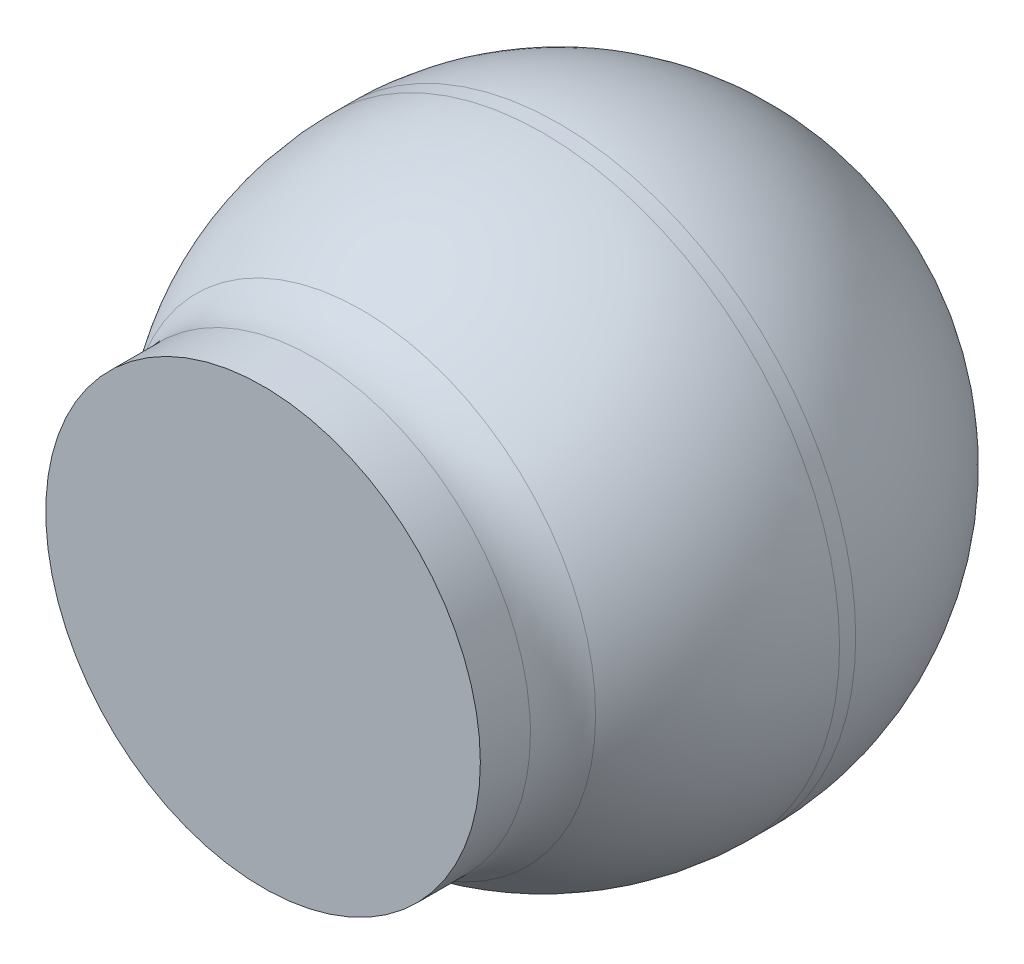
ISO-10303-21;
HEADER;
FILE_DESCRIPTION(('STEP AP214'),'2;1');
FILE_NAME('part.step','',(''),(''),'','','');
FILE_SCHEMA(('AUTOMOTIVE_DESIGN { 1 0 10303 214 1 1 1 1 }'));
ENDSEC;
DATA;
#1=APPLICATION_CONTEXT('core data for automotive mechanical design processes');
#2=APPLICATION_PROTOCOL_DEFINITION('international standard','automotive_design',2000,#1);
#3=PRODUCT_CONTEXT('',#1,'mechanical');
#4=PRODUCT('Part','Part','',(#3));
#5=PRODUCT_RELATED_PRODUCT_CATEGORY('part','',(#4));
#6=PRODUCT_DEFINITION_FORMATION('','',#4);
#7=PRODUCT_DEFINITION_CONTEXT('part definition',#1,'design');
#8=PRODUCT_DEFINITION('design','',#6,#7);
#9=PRODUCT_DEFINITION_SHAPE('','',#8);
#10=(LENGTH_UNIT() NAMED_UNIT(*) SI_UNIT(.MILLI.,.METRE.));
#11=(NAMED_UNIT(*) PLANE_ANGLE_UNIT() SI_UNIT($,.RADIAN.));
#12=(NAMED_UNIT(*) SI_UNIT($,.STERADIAN.) SOLID_ANGLE_UNIT());
#13=UNCERTAINTY_MEASURE_WITH_UNIT(LENGTH_MEASURE(1.E-05),#10,'distance_accuracy_value','');
#14=(GEOMETRIC_REPRESENTATION_CONTEXT(3) GLOBAL_UNCERTAINTY_ASSIGNED_CONTEXT((#13)) GLOBAL_UNIT_ASSIGNED_CONTEXT((#10,
#11,#12)) REPRESENTATION_CONTEXT('',''));
#15=CARTESIAN_POINT('',(0.,0.,0.));
#16=DIRECTION('',(0.,0.,1.));
#17=DIRECTION('',(1.,0.,0.));
#18=AXIS2_PLACEMENT_3D('',#15,#16,#17);
#19=CARTESIAN_POINT('',(-4.372919922269,-11.67134929145,10.006534503384));
#20=DIRECTION('',(0.,0.,-1.));
#21=DIRECTION('',(-1.,0.,0.));
#22=AXIS2_PLACEMENT_3D('',#19,#20,#21);
#23=PLANE('',#22);
#24=CARTESIAN_POINT('',(-4.372919922269,-11.67134929145,10.006534503384));
#25=DIRECTION('',(0.,0.,1.));
#26=DIRECTION('',(1.,0.,0.));
#27=AXIS2_PLACEMENT_3D('',#24,#25,#26);
#28=CIRCLE('',#27,0.275);
#29=CARTESIAN_POINT('',(-4.097919922269,-11.67134929145,10.006534503384));
#30=VERTEX_POINT('',#29);
#31=EDGE_CURVE('E20',#30,#30,#28,.F.);
#32=ORIENTED_EDGE('',*,*,#31,.F.);
#33=EDGE_LOOP('',(#32));
#34=FACE_BOUND('',#33,.T.);
#35=ADVANCED_FACE('F17',(#34),#23,.F.);
#36=CARTESIAN_POINT('',(-4.372919922269,-11.67134929145,9.906534503384));
#37=DIRECTION('',(0.,0.,1.));
#38=DIRECTION('',(1.,0.,0.));
#39=AXIS2_PLACEMENT_3D('',#36,#37,#38);
#40=CYLINDRICAL_SURFACE('',#39,0.275);
#41=CARTESIAN_POINT('',(-4.372919922269,-11.67134929145,9.943180457728));
#42=DIRECTION('',(0.,0.,-1.));
#43=DIRECTION('',(0.996700902337582,0.081162252799247,0.));
#44=AXIS2_PLACEMENT_3D('',#41,#42,#43);
#45=CIRCLE('',#44,0.275);
#46=CARTESIAN_POINT('',(-4.09882717412617,-11.6490296719302,9.943180457728));
#47=VERTEX_POINT('',#46);
#48=EDGE_CURVE('E66',#47,#47,#45,.F.);
#49=ORIENTED_EDGE('',*,*,#48,.T.);
#50=EDGE_LOOP('',(#49));
#51=FACE_BOUND('',#50,.T.);
#52=ORIENTED_EDGE('',*,*,#31,.T.);
#53=EDGE_LOOP('',(#52));
#54=FACE_BOUND('',#53,.T.);
#55=ADVANCED_FACE('F62',(#51,#54),#40,.T.);
#56=CARTESIAN_POINT('',(-4.372919922269,-11.67134929145,9.943180457728));
#57=DIRECTION('',(0.,0.,-1.));
#58=DIRECTION('',(0.996700902337583,0.0811622527992448,0.));
#59=AXIS2_PLACEMENT_3D('',#56,#57,#58);
#60=TOROIDAL_SURFACE('',#59,0.375,0.1);
#61=ORIENTED_EDGE('',*,*,#48,.F.);
#62=EDGE_LOOP('',(#61));
#63=FACE_BOUND('',#62,.T.);
#64=CARTESIAN_POINT('',(-4.372919922269,-11.67134929145,9.881744931236));
#65=DIRECTION('',(0.,0.,-1.));
#66=DIRECTION('',(-0.996700902338691,-0.0811622527856354,0.));
#67=AXIS2_PLACEMENT_3D('',#64,#65,#66);
#68=CIRCLE('',#67,0.29609704641234);
#69=CARTESIAN_POINT('',(-4.668040115608,-11.69538119478,9.881744931236));
#70=VERTEX_POINT('',#69);
#71=EDGE_CURVE('E39',#70,#70,#68,.T.);
#72=ORIENTED_EDGE('',*,*,#71,.F.);
#73=EDGE_LOOP('',(#72));
#74=FACE_BOUND('',#73,.T.);
#75=ADVANCED_FACE('F57',(#63,#74),#60,.F.);
#76=CARTESIAN_POINT('',(-4.746682760645,-11.70178513625,9.651976062157));
#77=CARTESIAN_POINT('',(-4.746682760645,-11.70178513625,9.701461392103));
#78=CARTESIAN_POINT('',(-4.738526217348,-11.70112094157,9.750947004335));
#79=CARTESIAN_POINT('',(-4.722207085349,-11.69979205995,9.798626332798));
#80=CARTESIAN_POINT('',(-4.698341390838,-11.69784865493,9.842699544317));
#81=CARTESIAN_POINT('',(-4.668040115608,-11.69538119478,9.881744931236));
#82=(BOUNDED_CURVE() B_SPLINE_CURVE(5,(#76,#77,#78,#79,#80,#81),.UNSPECIFIED.,.F.,
.F.) B_SPLINE_CURVE_WITH_KNOTS((6,6),(0.,0.661568582165),
.UNSPECIFIED.) CURVE() GEOMETRIC_REPRESENTATION_ITEM() RATIONAL_B_SPLINE_CURVE((1.,1.,1.,1.,1.,1.)) REPRESENTATION_ITEM(''));
#83=CARTESIAN_POINT('',(-4.372919922269,-11.67134929145,9.651976062157));
#84=DIRECTION('',(0.,0.,-1.));
#85=AXIS1_PLACEMENT('',#83,#84);
#86=SURFACE_OF_REVOLUTION('',#82,#85);
#87=CARTESIAN_POINT('',(-4.372919922269,-11.67134929145,9.651976062157));
#88=DIRECTION('',(0.,0.,1.));
#89=DIRECTION('',(1.,0.,0.));
#90=AXIS2_PLACEMENT_3D('',#87,#88,#89);
#91=CIRCLE('',#90,0.375);
#92=CARTESIAN_POINT('',(-3.997919922269,-11.67134929145,9.651976062157));
#93=VERTEX_POINT('',#92);
#94=EDGE_CURVE('E36',#93,#93,#91,.F.);
#95=ORIENTED_EDGE('',*,*,#94,.F.);
#96=EDGE_LOOP('',(#95));
#97=FACE_BOUND('',#96,.T.);
#98=ORIENTED_EDGE('',*,*,#71,.T.);
#99=EDGE_LOOP('',(#98));
#100=FACE_BOUND('',#99,.T.);
#101=ADVANCED_FACE('F53',(#97,#100),#86,.F.);
#102=CARTESIAN_POINT('',(-4.372919922269,-11.67134929145,9.256534503384));
#103=DIRECTION('',(0.,0.,1.));
#104=DIRECTION('',(1.,0.,0.));
#105=AXIS2_PLACEMENT_3D('',#102,#103,#104);
#106=CYLINDRICAL_SURFACE('',#105,0.375);
#107=CARTESIAN_POINT('',(-4.372919922269,-11.67134929145,9.631534503384));
#108=DIRECTION('',(0.,0.,-1.));
#109=DIRECTION('',(0.0811622527992357,-0.996700902337583,0.));
#110=AXIS2_PLACEMENT_3D('',#107,#108,#109);
#111=CIRCLE('',#110,0.375);
#112=CARTESIAN_POINT('',(-4.34248407746929,-12.0451121298266,9.631534503384));
#113=VERTEX_POINT('',#112);
#114=CARTESIAN_POINT('',(-4.40335576706871,-11.2975864530734,9.631534503384));
#115=VERTEX_POINT('',#114);
#116=EDGE_CURVE('E11',#113,#115,#111,.T.);
#117=ORIENTED_EDGE('',*,*,#116,.F.);
#118=CARTESIAN_POINT('',(-4.372919922269,-11.67134929145,9.631534503384));
#119=DIRECTION('',(3.33436315446763E-12,2.72100352061447E-13,1.));
#120=DIRECTION('',(0.0811622527992365,-0.996700902337583,0.));
#121=AXIS2_PLACEMENT_3D('',#118,#119,#120);
#122=CIRCLE('',#121,0.375);
#123=EDGE_CURVE('E25',#115,#113,#122,.F.);
#124=ORIENTED_EDGE('',*,*,#123,.F.);
#125=EDGE_LOOP('',(#117,#124));
#126=FACE_BOUND('',#125,.T.);
#127=ORIENTED_EDGE('',*,*,#94,.T.);
#128=EDGE_LOOP('',(#127));
#129=FACE_BOUND('',#128,.T.);
#130=ADVANCED_FACE('F34',(#126,#129),#106,.T.);
#131=CARTESIAN_POINT('',(-4.372919922269,-11.67134929145,9.631534503384));
#132=DIRECTION('',(0.0811622527992361,-0.996700902337583,0.));
#133=DIRECTION('',(-0.996700902337583,-0.0811622527992361,0.));
#134=AXIS2_PLACEMENT_3D('',#131,#132,#133);
#135=SPHERICAL_SURFACE('',#134,0.375);
#136=ORIENTED_EDGE('',*,*,#123,.T.);
#137=ORIENTED_EDGE('',*,*,#116,.T.);
#138=EDGE_LOOP('',(#136,#137));
#139=FACE_BOUND('',#138,.T.);
#140=ADVANCED_FACE('F32',(#139),#135,.T.);
#141=CLOSED_SHELL('',(#35,#55,#75,#101,#130,#140));
#142=MANIFOLD_SOLID_BREP('B1',#141);
#143=ADVANCED_BREP_SHAPE_REPRESENTATION('',(#18,#142),#14);
#144=SHAPE_DEFINITION_REPRESENTATION(#9,#143);
ENDSEC;
END-ISO-10303-21;
